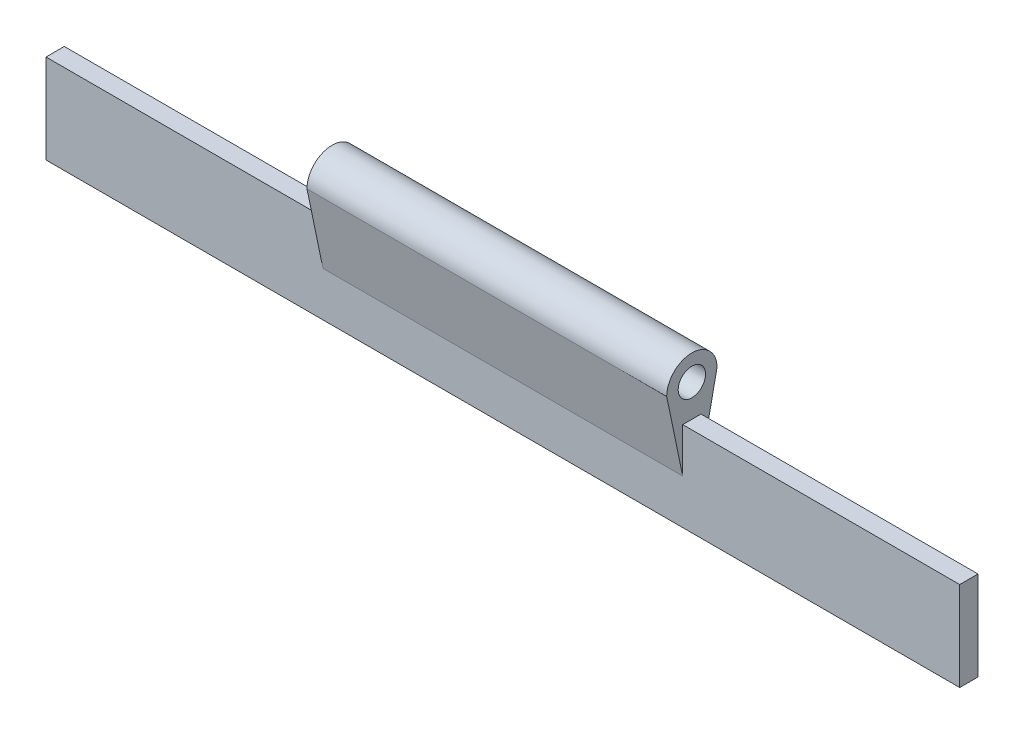
ISO-10303-21;
HEADER;
FILE_DESCRIPTION(('STEP AP214'),'2;1');
FILE_NAME('part.step','',(''),(''),'','','');
FILE_SCHEMA(('AUTOMOTIVE_DESIGN { 1 0 10303 214 1 1 1 1 }'));
ENDSEC;
DATA;
#1=APPLICATION_CONTEXT('core data for automotive mechanical design processes');
#2=APPLICATION_PROTOCOL_DEFINITION('international standard','automotive_design',2000,#1);
#3=PRODUCT_CONTEXT('',#1,'mechanical');
#4=PRODUCT('Part','Part','',(#3));
#5=PRODUCT_RELATED_PRODUCT_CATEGORY('part','',(#4));
#6=PRODUCT_DEFINITION_FORMATION('','',#4);
#7=PRODUCT_DEFINITION_CONTEXT('part definition',#1,'design');
#8=PRODUCT_DEFINITION('design','',#6,#7);
#9=PRODUCT_DEFINITION_SHAPE('','',#8);
#10=(LENGTH_UNIT() NAMED_UNIT(*) SI_UNIT(.MILLI.,.METRE.));
#11=(NAMED_UNIT(*) PLANE_ANGLE_UNIT() SI_UNIT($,.RADIAN.));
#12=(NAMED_UNIT(*) SI_UNIT($,.STERADIAN.) SOLID_ANGLE_UNIT());
#13=UNCERTAINTY_MEASURE_WITH_UNIT(LENGTH_MEASURE(1.E-05),#10,'distance_accuracy_value','');
#14=(GEOMETRIC_REPRESENTATION_CONTEXT(3) GLOBAL_UNCERTAINTY_ASSIGNED_CONTEXT((#13)) GLOBAL_UNIT_ASSIGNED_CONTEXT((#10,
#11,#12)) REPRESENTATION_CONTEXT('',''));
#15=CARTESIAN_POINT('',(0.,0.,0.));
#16=DIRECTION('',(0.,0.,1.));
#17=DIRECTION('',(1.,0.,0.));
#18=AXIS2_PLACEMENT_3D('',#15,#16,#17);
#19=CARTESIAN_POINT('',(-63.5,12.4,2.54));
#20=DIRECTION('',(0.,-1.,0.));
#21=DIRECTION('',(0.,0.,-1.));
#22=AXIS2_PLACEMENT_3D('',#19,#20,#21);
#23=PLANE('',#22);
#24=DIRECTION('',(0.,0.,1.));
#25=VECTOR('',#24,1.);
#26=CARTESIAN_POINT('',(-25.,12.4,2.54));
#27=LINE('',#26,#25);
#28=CARTESIAN_POINT('',(-25.,12.4,0.));
#29=VERTEX_POINT('',#28);
#30=CARTESIAN_POINT('',(-25.,12.4,2.54));
#31=VERTEX_POINT('',#30);
#32=EDGE_CURVE('E198',#29,#31,#27,.T.);
#33=ORIENTED_EDGE('',*,*,#32,.F.);
#34=DIRECTION('',(-1.,0.,0.));
#35=VECTOR('',#34,1.);
#36=CARTESIAN_POINT('',(-63.5,12.4,0.));
#37=LINE('',#36,#35);
#38=CARTESIAN_POINT('',(-63.5,12.4,0.));
#39=VERTEX_POINT('',#38);
#40=EDGE_CURVE('E142',#29,#39,#37,.T.);
#41=ORIENTED_EDGE('',*,*,#40,.T.);
#42=DIRECTION('',(0.,0.,-1.));
#43=VECTOR('',#42,1.);
#44=CARTESIAN_POINT('',(-63.5,12.4,2.54));
#45=LINE('',#44,#43);
#46=CARTESIAN_POINT('',(-63.5,12.4,2.54));
#47=VERTEX_POINT('',#46);
#48=EDGE_CURVE('E156',#47,#39,#45,.T.);
#49=ORIENTED_EDGE('',*,*,#48,.F.);
#50=DIRECTION('',(-1.,0.,0.));
#51=VECTOR('',#50,1.);
#52=CARTESIAN_POINT('',(-63.5,12.4,2.54));
#53=LINE('',#52,#51);
#54=EDGE_CURVE('E184',#31,#47,#53,.T.);
#55=ORIENTED_EDGE('',*,*,#54,.F.);
#56=EDGE_LOOP('',(#33,#41,#49,#55));
#57=FACE_BOUND('',#56,.T.);
#58=ADVANCED_FACE('F39',(#57),#23,.F.);
#59=CARTESIAN_POINT('',(-63.5,12.4,2.54));
#60=DIRECTION('',(1.,0.,0.));
#61=DIRECTION('',(0.,0.,-1.));
#62=AXIS2_PLACEMENT_3D('',#59,#60,#61);
#63=PLANE('',#62);
#64=DIRECTION('',(0.,-1.,0.));
#65=VECTOR('',#64,1.);
#66=CARTESIAN_POINT('',(-63.5,12.4,0.));
#67=LINE('',#66,#65);
#68=CARTESIAN_POINT('',(-63.5,0.,0.));
#69=VERTEX_POINT('',#68);
#70=EDGE_CURVE('E144',#39,#69,#67,.T.);
#71=ORIENTED_EDGE('',*,*,#70,.T.);
#72=DIRECTION('',(0.,0.,-1.));
#73=VECTOR('',#72,1.);
#74=CARTESIAN_POINT('',(-63.5,0.,2.54));
#75=LINE('',#74,#73);
#76=CARTESIAN_POINT('',(-63.5,0.,2.54));
#77=VERTEX_POINT('',#76);
#78=EDGE_CURVE('E165',#77,#69,#75,.T.);
#79=ORIENTED_EDGE('',*,*,#78,.F.);
#80=DIRECTION('',(0.,-1.,0.));
#81=VECTOR('',#80,1.);
#82=CARTESIAN_POINT('',(-63.5,12.4,2.54));
#83=LINE('',#82,#81);
#84=EDGE_CURVE('E151',#47,#77,#83,.T.);
#85=ORIENTED_EDGE('',*,*,#84,.F.);
#86=ORIENTED_EDGE('',*,*,#48,.T.);
#87=EDGE_LOOP('',(#71,#79,#85,#86));
#88=FACE_BOUND('',#87,.T.);
#89=ADVANCED_FACE('F41',(#88),#63,.F.);
#90=CARTESIAN_POINT('',(-63.5,0.,2.54));
#91=DIRECTION('',(0.,1.,0.));
#92=DIRECTION('',(0.,0.,1.));
#93=AXIS2_PLACEMENT_3D('',#90,#91,#92);
#94=PLANE('',#93);
#95=DIRECTION('',(1.,0.,0.));
#96=VECTOR('',#95,1.);
#97=CARTESIAN_POINT('',(-63.5,0.,0.));
#98=LINE('',#97,#96);
#99=CARTESIAN_POINT('',(63.5,0.,0.));
#100=VERTEX_POINT('',#99);
#101=EDGE_CURVE('E152',#69,#100,#98,.T.);
#102=ORIENTED_EDGE('',*,*,#101,.T.);
#103=DIRECTION('',(0.,0.,-1.));
#104=VECTOR('',#103,1.);
#105=CARTESIAN_POINT('',(63.5,0.,2.54));
#106=LINE('',#105,#104);
#107=CARTESIAN_POINT('',(63.5,0.,2.54));
#108=VERTEX_POINT('',#107);
#109=EDGE_CURVE('E162',#108,#100,#106,.T.);
#110=ORIENTED_EDGE('',*,*,#109,.F.);
#111=DIRECTION('',(1.,0.,0.));
#112=VECTOR('',#111,1.);
#113=CARTESIAN_POINT('',(-63.5,0.,2.54));
#114=LINE('',#113,#112);
#115=EDGE_CURVE('E180',#77,#108,#114,.T.);
#116=ORIENTED_EDGE('',*,*,#115,.F.);
#117=ORIENTED_EDGE('',*,*,#78,.T.);
#118=EDGE_LOOP('',(#102,#110,#116,#117));
#119=FACE_BOUND('',#118,.T.);
#120=ADVANCED_FACE('F188',(#119),#94,.F.);
#121=CARTESIAN_POINT('',(63.5,12.4,2.54));
#122=DIRECTION('',(-1.,0.,0.));
#123=DIRECTION('',(0.,-1.,0.));
#124=AXIS2_PLACEMENT_3D('',#121,#122,#123);
#125=PLANE('',#124);
#126=DIRECTION('',(0.,1.,0.));
#127=VECTOR('',#126,1.);
#128=CARTESIAN_POINT('',(63.5,12.4,0.));
#129=LINE('',#128,#127);
#130=CARTESIAN_POINT('',(63.5,12.4,0.));
#131=VERTEX_POINT('',#130);
#132=EDGE_CURVE('E149',#100,#131,#129,.T.);
#133=ORIENTED_EDGE('',*,*,#132,.T.);
#134=DIRECTION('',(0.,0.,-1.));
#135=VECTOR('',#134,1.);
#136=CARTESIAN_POINT('',(63.5,12.4,2.54));
#137=LINE('',#136,#135);
#138=CARTESIAN_POINT('',(63.5,12.4,2.54));
#139=VERTEX_POINT('',#138);
#140=EDGE_CURVE('E158',#139,#131,#137,.T.);
#141=ORIENTED_EDGE('',*,*,#140,.F.);
#142=DIRECTION('',(0.,1.,0.));
#143=VECTOR('',#142,1.);
#144=CARTESIAN_POINT('',(63.5,12.4,2.54));
#145=LINE('',#144,#143);
#146=EDGE_CURVE('E182',#108,#139,#145,.T.);
#147=ORIENTED_EDGE('',*,*,#146,.F.);
#148=ORIENTED_EDGE('',*,*,#109,.T.);
#149=EDGE_LOOP('',(#133,#141,#147,#148));
#150=FACE_BOUND('',#149,.T.);
#151=ADVANCED_FACE('F192',(#150),#125,.F.);
#152=CARTESIAN_POINT('',(25.,12.4,0.));
#153=VERTEX_POINT('',#152);
#154=EDGE_CURVE('E148',#131,#153,#37,.T.);
#155=ORIENTED_EDGE('',*,*,#154,.T.);
#156=DIRECTION('',(0.,0.,1.));
#157=VECTOR('',#156,1.);
#158=CARTESIAN_POINT('',(25.,12.4,2.54));
#159=LINE('',#158,#157);
#160=CARTESIAN_POINT('',(25.,12.4,2.54));
#161=VERTEX_POINT('',#160);
#162=EDGE_CURVE('E62',#153,#161,#159,.T.);
#163=ORIENTED_EDGE('',*,*,#162,.T.);
#164=EDGE_CURVE('E159',#139,#161,#53,.T.);
#165=ORIENTED_EDGE('',*,*,#164,.F.);
#166=ORIENTED_EDGE('',*,*,#140,.T.);
#167=EDGE_LOOP('',(#155,#163,#165,#166));
#168=FACE_BOUND('',#167,.T.);
#169=ADVANCED_FACE('F170',(#168),#23,.F.);
#170=CARTESIAN_POINT('',(0.,0.,2.54));
#171=DIRECTION('',(0.,0.,1.));
#172=DIRECTION('',(1.,0.,0.));
#173=AXIS2_PLACEMENT_3D('',#170,#171,#172);
#174=PLANE('',#173);
#175=DIRECTION('',(-1.,0.,0.));
#176=VECTOR('',#175,1.);
#177=CARTESIAN_POINT('',(25.,6.2,2.54));
#178=LINE('',#177,#176);
#179=CARTESIAN_POINT('',(25.,6.2,2.54));
#180=VERTEX_POINT('',#179);
#181=CARTESIAN_POINT('',(-25.,6.2,2.54));
#182=VERTEX_POINT('',#181);
#183=EDGE_CURVE('E215',#180,#182,#178,.T.);
#184=ORIENTED_EDGE('',*,*,#183,.T.);
#185=DIRECTION('',(0.,1.,0.));
#186=VECTOR('',#185,1.);
#187=CARTESIAN_POINT('',(-25.,0.,2.54));
#188=LINE('',#187,#186);
#189=EDGE_CURVE('E199',#182,#31,#188,.T.);
#190=ORIENTED_EDGE('',*,*,#189,.T.);
#191=ORIENTED_EDGE('',*,*,#54,.T.);
#192=ORIENTED_EDGE('',*,*,#84,.T.);
#193=ORIENTED_EDGE('',*,*,#115,.T.);
#194=ORIENTED_EDGE('',*,*,#146,.T.);
#195=ORIENTED_EDGE('',*,*,#164,.T.);
#196=DIRECTION('',(0.,1.,0.));
#197=VECTOR('',#196,1.);
#198=CARTESIAN_POINT('',(25.,0.,2.54));
#199=LINE('',#198,#197);
#200=EDGE_CURVE('E54',#180,#161,#199,.T.);
#201=ORIENTED_EDGE('',*,*,#200,.F.);
#202=EDGE_LOOP('',(#184,#190,#191,#192,#193,#194,#195,#201));
#203=FACE_BOUND('',#202,.T.);
#204=ADVANCED_FACE('F193',(#203),#174,.T.);
#205=CARTESIAN_POINT('',(0.,0.,0.));
#206=DIRECTION('',(0.,0.,1.));
#207=DIRECTION('',(1.,0.,0.));
#208=AXIS2_PLACEMENT_3D('',#205,#206,#207);
#209=PLANE('',#208);
#210=DIRECTION('',(0.,1.,0.));
#211=VECTOR('',#210,1.);
#212=CARTESIAN_POINT('',(-25.,0.,0.));
#213=LINE('',#212,#211);
#214=CARTESIAN_POINT('',(-25.,6.2,0.));
#215=VERTEX_POINT('',#214);
#216=EDGE_CURVE('E11',#215,#29,#213,.T.);
#217=ORIENTED_EDGE('',*,*,#216,.F.);
#218=DIRECTION('',(-1.,0.,0.));
#219=VECTOR('',#218,1.);
#220=CARTESIAN_POINT('',(25.,6.2,0.));
#221=LINE('',#220,#219);
#222=CARTESIAN_POINT('',(25.,6.2,0.));
#223=VERTEX_POINT('',#222);
#224=EDGE_CURVE('E117',#223,#215,#221,.T.);
#225=ORIENTED_EDGE('',*,*,#224,.F.);
#226=DIRECTION('',(0.,1.,0.));
#227=VECTOR('',#226,1.);
#228=CARTESIAN_POINT('',(25.,0.,0.));
#229=LINE('',#228,#227);
#230=EDGE_CURVE('E47',#223,#153,#229,.T.);
#231=ORIENTED_EDGE('',*,*,#230,.T.);
#232=ORIENTED_EDGE('',*,*,#154,.F.);
#233=ORIENTED_EDGE('',*,*,#132,.F.);
#234=ORIENTED_EDGE('',*,*,#101,.F.);
#235=ORIENTED_EDGE('',*,*,#70,.F.);
#236=ORIENTED_EDGE('',*,*,#40,.F.);
#237=EDGE_LOOP('',(#217,#225,#231,#232,#233,#234,#235,#236));
#238=FACE_BOUND('',#237,.T.);
#239=ADVANCED_FACE('F140',(#238),#209,.F.);
#240=CARTESIAN_POINT('',(25.,16.9,1.27));
#241=DIRECTION('',(1.,0.,0.));
#242=DIRECTION('',(0.,0.,-1.));
#243=AXIS2_PLACEMENT_3D('',#240,#241,#242);
#244=PLANE('',#243);
#245=DIRECTION('',(0.,-0.978965193703682,-0.204027325416749));
#246=VECTOR('',#245,1.);
#247=CARTESIAN_POINT('',(25.,6.2,2.54));
#248=LINE('',#247,#246);
#249=CARTESIAN_POINT('',(25.,16.9,4.77));
#250=VERTEX_POINT('',#249);
#251=EDGE_CURVE('E213',#250,#180,#248,.T.);
#252=ORIENTED_EDGE('',*,*,#251,.T.);
#253=ORIENTED_EDGE('',*,*,#200,.T.);
#254=ORIENTED_EDGE('',*,*,#162,.F.);
#255=ORIENTED_EDGE('',*,*,#230,.F.);
#256=DIRECTION('',(0.,0.978965193703682,-0.204027325416749));
#257=VECTOR('',#256,1.);
#258=CARTESIAN_POINT('',(25.,6.2,0.));
#259=LINE('',#258,#257);
#260=CARTESIAN_POINT('',(25.,16.9,-2.23));
#261=VERTEX_POINT('',#260);
#262=EDGE_CURVE('E122',#223,#261,#259,.T.);
#263=ORIENTED_EDGE('',*,*,#262,.T.);
#264=CARTESIAN_POINT('',(25.,16.9,1.27));
#265=DIRECTION('',(1.,0.,0.));
#266=DIRECTION('',(0.,0.,-1.));
#267=AXIS2_PLACEMENT_3D('',#264,#265,#266);
#268=CIRCLE('',#267,3.5);
#269=EDGE_CURVE('E211',#261,#250,#268,.T.);
#270=ORIENTED_EDGE('',*,*,#269,.T.);
#271=EDGE_LOOP('',(#252,#253,#254,#255,#263,#270));
#272=FACE_BOUND('',#271,.T.);
#273=CARTESIAN_POINT('',(25.,16.9,1.27));
#274=DIRECTION('',(1.,0.,0.));
#275=DIRECTION('',(0.,0.,-1.));
#276=AXIS2_PLACEMENT_3D('',#273,#274,#275);
#277=CIRCLE('',#276,1.9);
#278=CARTESIAN_POINT('',(25.,16.9,-0.63));
#279=VERTEX_POINT('',#278);
#280=EDGE_CURVE('E202',#279,#279,#277,.T.);
#281=ORIENTED_EDGE('',*,*,#280,.F.);
#282=EDGE_LOOP('',(#281));
#283=FACE_BOUND('',#282,.T.);
#284=ADVANCED_FACE('F172',(#272,#283),#244,.T.);
#285=CARTESIAN_POINT('',(25.,6.2,0.));
#286=DIRECTION('',(0.,0.204027325416749,0.978965193703682));
#287=DIRECTION('',(0.,-0.978965193703682,0.204027325416749));
#288=AXIS2_PLACEMENT_3D('',#285,#286,#287);
#289=PLANE('',#288);
#290=ORIENTED_EDGE('',*,*,#224,.T.);
#291=DIRECTION('',(0.,0.978965193703682,-0.204027325416749));
#292=VECTOR('',#291,1.);
#293=CARTESIAN_POINT('',(-25.,6.2,0.));
#294=LINE('',#293,#292);
#295=CARTESIAN_POINT('',(-25.,16.9,-2.23));
#296=VERTEX_POINT('',#295);
#297=EDGE_CURVE('E121',#215,#296,#294,.T.);
#298=ORIENTED_EDGE('',*,*,#297,.T.);
#299=DIRECTION('',(-1.,0.,0.));
#300=VECTOR('',#299,1.);
#301=CARTESIAN_POINT('',(25.,16.9,-2.23));
#302=LINE('',#301,#300);
#303=EDGE_CURVE('E126',#261,#296,#302,.T.);
#304=ORIENTED_EDGE('',*,*,#303,.F.);
#305=ORIENTED_EDGE('',*,*,#262,.F.);
#306=EDGE_LOOP('',(#290,#298,#304,#305));
#307=FACE_BOUND('',#306,.T.);
#308=ADVANCED_FACE('F119',(#307),#289,.F.);
#309=CARTESIAN_POINT('',(25.,16.9,1.27));
#310=DIRECTION('',(-1.,0.,0.));
#311=DIRECTION('',(0.,0.,1.));
#312=AXIS2_PLACEMENT_3D('',#309,#310,#311);
#313=CYLINDRICAL_SURFACE('',#312,3.5);
#314=ORIENTED_EDGE('',*,*,#303,.T.);
#315=CARTESIAN_POINT('',(-25.,16.9,1.27));
#316=DIRECTION('',(1.,0.,0.));
#317=DIRECTION('',(0.,0.,-1.));
#318=AXIS2_PLACEMENT_3D('',#315,#316,#317);
#319=CIRCLE('',#318,3.5);
#320=CARTESIAN_POINT('',(-25.,16.9,4.77));
#321=VERTEX_POINT('',#320);
#322=EDGE_CURVE('E136',#296,#321,#319,.T.);
#323=ORIENTED_EDGE('',*,*,#322,.T.);
#324=DIRECTION('',(-1.,0.,0.));
#325=VECTOR('',#324,1.);
#326=CARTESIAN_POINT('',(25.,16.9,4.77));
#327=LINE('',#326,#325);
#328=EDGE_CURVE('E217',#250,#321,#327,.T.);
#329=ORIENTED_EDGE('',*,*,#328,.F.);
#330=ORIENTED_EDGE('',*,*,#269,.F.);
#331=EDGE_LOOP('',(#314,#323,#329,#330));
#332=FACE_BOUND('',#331,.T.);
#333=ADVANCED_FACE('F220',(#332),#313,.T.);
#334=CARTESIAN_POINT('',(25.,6.2,2.54));
#335=DIRECTION('',(0.,0.204027325416749,-0.978965193703682));
#336=DIRECTION('',(0.,0.978965193703682,0.204027325416749));
#337=AXIS2_PLACEMENT_3D('',#334,#335,#336);
#338=PLANE('',#337);
#339=ORIENTED_EDGE('',*,*,#328,.T.);
#340=DIRECTION('',(0.,-0.978965193703682,-0.204027325416749));
#341=VECTOR('',#340,1.);
#342=CARTESIAN_POINT('',(-25.,6.2,2.54));
#343=LINE('',#342,#341);
#344=EDGE_CURVE('E200',#321,#182,#343,.T.);
#345=ORIENTED_EDGE('',*,*,#344,.T.);
#346=ORIENTED_EDGE('',*,*,#183,.F.);
#347=ORIENTED_EDGE('',*,*,#251,.F.);
#348=EDGE_LOOP('',(#339,#345,#346,#347));
#349=FACE_BOUND('',#348,.T.);
#350=ADVANCED_FACE('F225',(#349),#338,.F.);
#351=CARTESIAN_POINT('',(25.,16.9,1.27));
#352=DIRECTION('',(-1.,0.,0.));
#353=DIRECTION('',(0.,0.,1.));
#354=AXIS2_PLACEMENT_3D('',#351,#352,#353);
#355=CYLINDRICAL_SURFACE('',#354,1.9);
#356=ORIENTED_EDGE('',*,*,#280,.T.);
#357=EDGE_LOOP('',(#356));
#358=FACE_BOUND('',#357,.T.);
#359=CARTESIAN_POINT('',(-25.,16.9,1.27));
#360=DIRECTION('',(1.,0.,0.));
#361=DIRECTION('',(0.,0.,-1.));
#362=AXIS2_PLACEMENT_3D('',#359,#360,#361);
#363=CIRCLE('',#362,1.9);
#364=CARTESIAN_POINT('',(-25.,16.9,-0.63));
#365=VERTEX_POINT('',#364);
#366=EDGE_CURVE('E137',#365,#365,#363,.T.);
#367=ORIENTED_EDGE('',*,*,#366,.F.);
#368=EDGE_LOOP('',(#367));
#369=FACE_BOUND('',#368,.T.);
#370=ADVANCED_FACE('F227',(#358,#369),#355,.F.);
#371=CARTESIAN_POINT('',(-25.,16.9,1.27));
#372=DIRECTION('',(1.,0.,0.));
#373=DIRECTION('',(0.,0.,-1.));
#374=AXIS2_PLACEMENT_3D('',#371,#372,#373);
#375=PLANE('',#374);
#376=ORIENTED_EDGE('',*,*,#189,.F.);
#377=ORIENTED_EDGE('',*,*,#344,.F.);
#378=ORIENTED_EDGE('',*,*,#322,.F.);
#379=ORIENTED_EDGE('',*,*,#297,.F.);
#380=ORIENTED_EDGE('',*,*,#216,.T.);
#381=ORIENTED_EDGE('',*,*,#32,.T.);
#382=EDGE_LOOP('',(#376,#377,#378,#379,#380,#381));
#383=FACE_BOUND('',#382,.T.);
#384=ORIENTED_EDGE('',*,*,#366,.T.);
#385=EDGE_LOOP('',(#384));
#386=FACE_BOUND('',#385,.T.);
#387=ADVANCED_FACE('F131',(#383,#386),#375,.F.);
#388=CLOSED_SHELL('',(#58,#89,#120,#151,#169,#204,#239,#284,#308,#333,#350,#370,#387));
#389=MANIFOLD_SOLID_BREP('B2',#388);
#390=ADVANCED_BREP_SHAPE_REPRESENTATION('',(#18,#389),#14);
#391=SHAPE_DEFINITION_REPRESENTATION(#9,#390);
ENDSEC;
END-ISO-10303-21;
